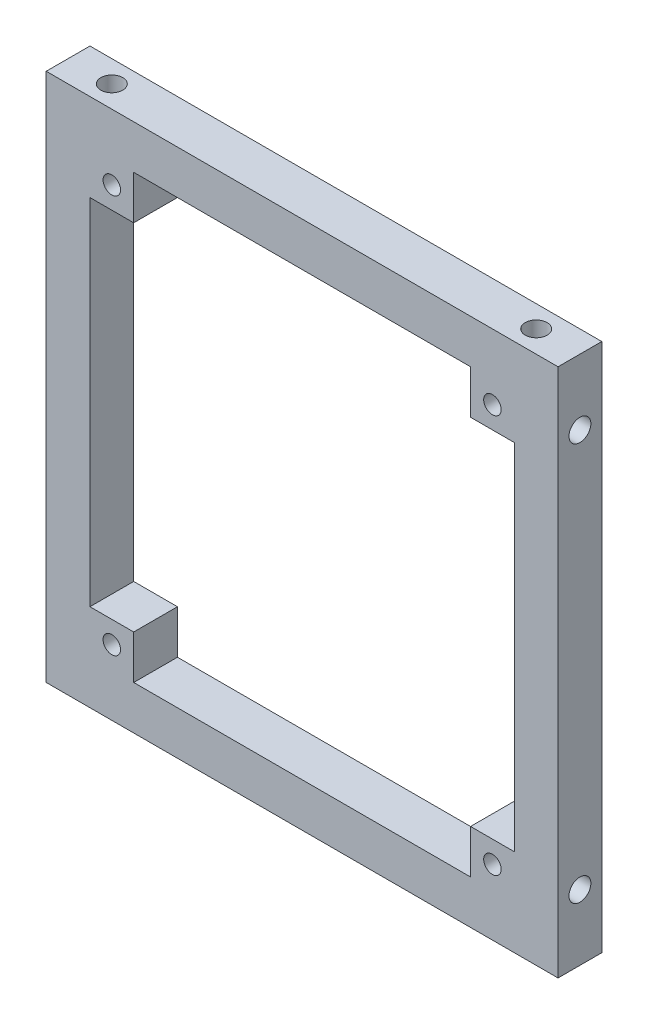
ISO-10303-21;
HEADER;
FILE_DESCRIPTION(('STEP AP214'),'2;1');
FILE_NAME('part.step','',(''),(''),'','','');
FILE_SCHEMA(('AUTOMOTIVE_DESIGN { 1 0 10303 214 1 1 1 1 }'));
ENDSEC;
DATA;
#1=APPLICATION_CONTEXT('core data for automotive mechanical design processes');
#2=APPLICATION_PROTOCOL_DEFINITION('international standard','automotive_design',2000,#1);
#3=PRODUCT_CONTEXT('',#1,'mechanical');
#4=PRODUCT('Part','Part','',(#3));
#5=PRODUCT_RELATED_PRODUCT_CATEGORY('part','',(#4));
#6=PRODUCT_DEFINITION_FORMATION('','',#4);
#7=PRODUCT_DEFINITION_CONTEXT('part definition',#1,'design');
#8=PRODUCT_DEFINITION('design','',#6,#7);
#9=PRODUCT_DEFINITION_SHAPE('','',#8);
#10=(LENGTH_UNIT() NAMED_UNIT(*) SI_UNIT(.MILLI.,.METRE.));
#11=(NAMED_UNIT(*) PLANE_ANGLE_UNIT() SI_UNIT($,.RADIAN.));
#12=(NAMED_UNIT(*) SI_UNIT($,.STERADIAN.) SOLID_ANGLE_UNIT());
#13=UNCERTAINTY_MEASURE_WITH_UNIT(LENGTH_MEASURE(1.E-05),#10,'distance_accuracy_value','');
#14=(GEOMETRIC_REPRESENTATION_CONTEXT(3) GLOBAL_UNCERTAINTY_ASSIGNED_CONTEXT((#13)) GLOBAL_UNIT_ASSIGNED_CONTEXT((#10,
#11,#12)) REPRESENTATION_CONTEXT('',''));
#15=CARTESIAN_POINT('',(0.,0.,0.));
#16=DIRECTION('',(0.,0.,1.));
#17=DIRECTION('',(1.,0.,0.));
#18=AXIS2_PLACEMENT_3D('',#15,#16,#17);
#19=CARTESIAN_POINT('',(0.,0.,4.));
#20=DIRECTION('',(0.,0.,1.));
#21=DIRECTION('',(1.,0.,0.));
#22=AXIS2_PLACEMENT_3D('',#19,#20,#21);
#23=PLANE('',#22);
#24=CARTESIAN_POINT('',(40.8000000000003,42.4,4.));
#25=DIRECTION('',(0.,0.,1.));
#26=DIRECTION('',(1.,0.,0.));
#27=AXIS2_PLACEMENT_3D('',#24,#25,#26);
#28=CIRCLE('',#27,0.799999999999996);
#29=CARTESIAN_POINT('',(41.6000000000003,42.4,4.));
#30=VERTEX_POINT('',#29);
#31=EDGE_CURVE('E367',#30,#30,#28,.T.);
#32=ORIENTED_EDGE('',*,*,#31,.F.);
#33=EDGE_LOOP('',(#32));
#34=FACE_BOUND('',#33,.T.);
#35=CARTESIAN_POINT('',(6.00000000000038,5.99999999999999,4.));
#36=DIRECTION('',(0.,0.,1.));
#37=DIRECTION('',(1.,0.,0.));
#38=AXIS2_PLACEMENT_3D('',#35,#36,#37);
#39=CIRCLE('',#38,0.8);
#40=CARTESIAN_POINT('',(6.80000000000038,5.99999999999999,4.));
#41=VERTEX_POINT('',#40);
#42=EDGE_CURVE('E195',#41,#41,#39,.T.);
#43=ORIENTED_EDGE('',*,*,#42,.F.);
#44=EDGE_LOOP('',(#43));
#45=FACE_BOUND('',#44,.T.);
#46=DIRECTION('',(0.,-1.,0.));
#47=VECTOR('',#46,1.);
#48=CARTESIAN_POINT('',(0.,48.4,4.));
#49=LINE('',#48,#47);
#50=CARTESIAN_POINT('',(0.,48.4,4.));
#51=VERTEX_POINT('',#50);
#52=CARTESIAN_POINT('',(0.,0.,4.));
#53=VERTEX_POINT('',#52);
#54=EDGE_CURVE('E245',#51,#53,#49,.T.);
#55=ORIENTED_EDGE('',*,*,#54,.T.);
#56=DIRECTION('',(1.,0.,0.));
#57=VECTOR('',#56,1.);
#58=CARTESIAN_POINT('',(0.,0.,4.));
#59=LINE('',#58,#57);
#60=CARTESIAN_POINT('',(46.8,0.,4.));
#61=VERTEX_POINT('',#60);
#62=EDGE_CURVE('E248',#53,#61,#59,.T.);
#63=ORIENTED_EDGE('',*,*,#62,.T.);
#64=DIRECTION('',(0.,1.,0.));
#65=VECTOR('',#64,1.);
#66=CARTESIAN_POINT('',(46.8,48.4,4.));
#67=LINE('',#66,#65);
#68=CARTESIAN_POINT('',(46.8,48.4,4.));
#69=VERTEX_POINT('',#68);
#70=EDGE_CURVE('E251',#61,#69,#67,.T.);
#71=ORIENTED_EDGE('',*,*,#70,.T.);
#72=DIRECTION('',(-1.,0.,0.));
#73=VECTOR('',#72,1.);
#74=CARTESIAN_POINT('',(0.,48.4,4.));
#75=LINE('',#74,#73);
#76=EDGE_CURVE('E253',#69,#51,#75,.T.);
#77=ORIENTED_EDGE('',*,*,#76,.T.);
#78=EDGE_LOOP('',(#55,#63,#71,#77));
#79=FACE_BOUND('',#78,.T.);
#80=DIRECTION('',(-1.,0.,0.));
#81=VECTOR('',#80,1.);
#82=CARTESIAN_POINT('',(4.,40.4,4.));
#83=LINE('',#82,#81);
#84=CARTESIAN_POINT('',(8.,40.4,4.));
#85=VERTEX_POINT('',#84);
#86=CARTESIAN_POINT('',(4.,40.4,4.));
#87=VERTEX_POINT('',#86);
#88=EDGE_CURVE('E157',#85,#87,#83,.T.);
#89=ORIENTED_EDGE('',*,*,#88,.F.);
#90=DIRECTION('',(0.,-1.,0.));
#91=VECTOR('',#90,1.);
#92=CARTESIAN_POINT('',(8.,44.4,4.));
#93=LINE('',#92,#91);
#94=CARTESIAN_POINT('',(8.,44.4,4.));
#95=VERTEX_POINT('',#94);
#96=EDGE_CURVE('E149',#95,#85,#93,.T.);
#97=ORIENTED_EDGE('',*,*,#96,.F.);
#98=DIRECTION('',(-1.,0.,0.));
#99=VECTOR('',#98,1.);
#100=CARTESIAN_POINT('',(8.,44.4,4.));
#101=LINE('',#100,#99);
#102=CARTESIAN_POINT('',(38.8,44.4,4.));
#103=VERTEX_POINT('',#102);
#104=EDGE_CURVE('E192',#103,#95,#101,.T.);
#105=ORIENTED_EDGE('',*,*,#104,.F.);
#106=DIRECTION('',(0.,1.,0.));
#107=VECTOR('',#106,1.);
#108=CARTESIAN_POINT('',(38.8,44.4,4.));
#109=LINE('',#108,#107);
#110=CARTESIAN_POINT('',(38.8,40.4,4.));
#111=VERTEX_POINT('',#110);
#112=EDGE_CURVE('E190',#111,#103,#109,.T.);
#113=ORIENTED_EDGE('',*,*,#112,.F.);
#114=DIRECTION('',(-1.,0.,0.));
#115=VECTOR('',#114,1.);
#116=CARTESIAN_POINT('',(38.8,40.4,4.));
#117=LINE('',#116,#115);
#118=CARTESIAN_POINT('',(42.8,40.4,4.));
#119=VERTEX_POINT('',#118);
#120=EDGE_CURVE('E188',#119,#111,#117,.T.);
#121=ORIENTED_EDGE('',*,*,#120,.F.);
#122=DIRECTION('',(0.,1.,0.));
#123=VECTOR('',#122,1.);
#124=CARTESIAN_POINT('',(42.8,40.4,4.));
#125=LINE('',#124,#123);
#126=CARTESIAN_POINT('',(42.8000000000004,7.99999999999999,4.));
#127=VERTEX_POINT('',#126);
#128=EDGE_CURVE('E186',#127,#119,#125,.T.);
#129=ORIENTED_EDGE('',*,*,#128,.F.);
#130=DIRECTION('',(1.,0.,0.));
#131=VECTOR('',#130,1.);
#132=CARTESIAN_POINT('',(38.8000000000004,7.99999999999999,4.));
#133=LINE('',#132,#131);
#134=CARTESIAN_POINT('',(38.8000000000004,7.99999999999999,4.));
#135=VERTEX_POINT('',#134);
#136=EDGE_CURVE('E184',#135,#127,#133,.T.);
#137=ORIENTED_EDGE('',*,*,#136,.F.);
#138=DIRECTION('',(0.,1.,0.));
#139=VECTOR('',#138,1.);
#140=CARTESIAN_POINT('',(38.8000000000004,7.99999999999999,4.));
#141=LINE('',#140,#139);
#142=CARTESIAN_POINT('',(38.8000000000004,3.99999999999999,4.));
#143=VERTEX_POINT('',#142);
#144=EDGE_CURVE('E182',#143,#135,#141,.T.);
#145=ORIENTED_EDGE('',*,*,#144,.F.);
#146=DIRECTION('',(1.,0.,0.));
#147=VECTOR('',#146,1.);
#148=CARTESIAN_POINT('',(8.00000000000038,3.99999999999999,4.));
#149=LINE('',#148,#147);
#150=CARTESIAN_POINT('',(8.00000000000038,3.99999999999999,4.));
#151=VERTEX_POINT('',#150);
#152=EDGE_CURVE('E180',#151,#143,#149,.T.);
#153=ORIENTED_EDGE('',*,*,#152,.F.);
#154=DIRECTION('',(0.,-1.,0.));
#155=VECTOR('',#154,1.);
#156=CARTESIAN_POINT('',(8.00000000000038,7.99999999999999,4.));
#157=LINE('',#156,#155);
#158=CARTESIAN_POINT('',(8.00000000000038,7.99999999999999,4.));
#159=VERTEX_POINT('',#158);
#160=EDGE_CURVE('E178',#159,#151,#157,.T.);
#161=ORIENTED_EDGE('',*,*,#160,.F.);
#162=DIRECTION('',(1.,0.,0.));
#163=VECTOR('',#162,1.);
#164=CARTESIAN_POINT('',(4.00000000000038,7.99999999999999,4.));
#165=LINE('',#164,#163);
#166=CARTESIAN_POINT('',(4.00000000000038,7.99999999999999,4.));
#167=VERTEX_POINT('',#166);
#168=EDGE_CURVE('E173',#167,#159,#165,.T.);
#169=ORIENTED_EDGE('',*,*,#168,.F.);
#170=DIRECTION('',(0.,-1.,0.));
#171=VECTOR('',#170,1.);
#172=CARTESIAN_POINT('',(4.,40.4,4.));
#173=LINE('',#172,#171);
#174=EDGE_CURVE('E171',#87,#167,#173,.T.);
#175=ORIENTED_EDGE('',*,*,#174,.F.);
#176=EDGE_LOOP('',(#89,#97,#105,#113,#121,#129,#137,#145,#153,#161,#169,#175));
#177=FACE_BOUND('',#176,.T.);
#178=CARTESIAN_POINT('',(40.8000000000004,5.99999999999999,4.));
#179=DIRECTION('',(0.,0.,1.));
#180=DIRECTION('',(1.,0.,0.));
#181=AXIS2_PLACEMENT_3D('',#178,#179,#180);
#182=CIRCLE('',#181,0.799999999999996);
#183=CARTESIAN_POINT('',(41.6000000000004,5.99999999999999,4.));
#184=VERTEX_POINT('',#183);
#185=EDGE_CURVE('E373',#184,#184,#182,.T.);
#186=ORIENTED_EDGE('',*,*,#185,.F.);
#187=EDGE_LOOP('',(#186));
#188=FACE_BOUND('',#187,.T.);
#189=CARTESIAN_POINT('',(6.00000000000025,42.4,4.));
#190=DIRECTION('',(0.,0.,1.));
#191=DIRECTION('',(1.,0.,0.));
#192=AXIS2_PLACEMENT_3D('',#189,#190,#191);
#193=CIRCLE('',#192,0.800000000000001);
#194=CARTESIAN_POINT('',(6.80000000000025,42.4,4.));
#195=VERTEX_POINT('',#194);
#196=EDGE_CURVE('E361',#195,#195,#193,.T.);
#197=ORIENTED_EDGE('',*,*,#196,.F.);
#198=EDGE_LOOP('',(#197));
#199=FACE_BOUND('',#198,.T.);
#200=ADVANCED_FACE('F36',(#34,#45,#79,#177,#188,#199),#23,.T.);
#201=CARTESIAN_POINT('',(0.,0.,0.));
#202=DIRECTION('',(0.,0.,1.));
#203=DIRECTION('',(1.,0.,0.));
#204=AXIS2_PLACEMENT_3D('',#201,#202,#203);
#205=PLANE('',#204);
#206=DIRECTION('',(0.,-1.,0.));
#207=VECTOR('',#206,1.);
#208=CARTESIAN_POINT('',(0.,48.4,0.));
#209=LINE('',#208,#207);
#210=CARTESIAN_POINT('',(0.,48.4,0.));
#211=VERTEX_POINT('',#210);
#212=CARTESIAN_POINT('',(0.,0.,0.));
#213=VERTEX_POINT('',#212);
#214=EDGE_CURVE('E165',#211,#213,#209,.T.);
#215=ORIENTED_EDGE('',*,*,#214,.F.);
#216=DIRECTION('',(-1.,0.,0.));
#217=VECTOR('',#216,1.);
#218=CARTESIAN_POINT('',(0.,48.4,0.));
#219=LINE('',#218,#217);
#220=CARTESIAN_POINT('',(46.8,48.4,0.));
#221=VERTEX_POINT('',#220);
#222=EDGE_CURVE('E249',#221,#211,#219,.T.);
#223=ORIENTED_EDGE('',*,*,#222,.F.);
#224=DIRECTION('',(0.,1.,0.));
#225=VECTOR('',#224,1.);
#226=CARTESIAN_POINT('',(46.8,48.4,0.));
#227=LINE('',#226,#225);
#228=CARTESIAN_POINT('',(46.8,0.,0.));
#229=VERTEX_POINT('',#228);
#230=EDGE_CURVE('E260',#229,#221,#227,.T.);
#231=ORIENTED_EDGE('',*,*,#230,.F.);
#232=DIRECTION('',(1.,0.,0.));
#233=VECTOR('',#232,1.);
#234=CARTESIAN_POINT('',(0.,0.,0.));
#235=LINE('',#234,#233);
#236=EDGE_CURVE('E258',#213,#229,#235,.T.);
#237=ORIENTED_EDGE('',*,*,#236,.F.);
#238=EDGE_LOOP('',(#215,#223,#231,#237));
#239=FACE_BOUND('',#238,.T.);
#240=DIRECTION('',(0.,-1.,0.));
#241=VECTOR('',#240,1.);
#242=CARTESIAN_POINT('',(8.,44.4,0.));
#243=LINE('',#242,#241);
#244=CARTESIAN_POINT('',(8.,44.4,0.));
#245=VERTEX_POINT('',#244);
#246=CARTESIAN_POINT('',(8.,40.4,0.));
#247=VERTEX_POINT('',#246);
#248=EDGE_CURVE('E59',#245,#247,#243,.T.);
#249=ORIENTED_EDGE('',*,*,#248,.T.);
#250=DIRECTION('',(-1.,0.,0.));
#251=VECTOR('',#250,1.);
#252=CARTESIAN_POINT('',(4.,40.4,0.));
#253=LINE('',#252,#251);
#254=CARTESIAN_POINT('',(4.,40.4,0.));
#255=VERTEX_POINT('',#254);
#256=EDGE_CURVE('E164',#247,#255,#253,.T.);
#257=ORIENTED_EDGE('',*,*,#256,.T.);
#258=DIRECTION('',(0.,-1.,0.));
#259=VECTOR('',#258,1.);
#260=CARTESIAN_POINT('',(4.,40.4,0.));
#261=LINE('',#260,#259);
#262=CARTESIAN_POINT('',(4.00000000000038,7.99999999999999,0.));
#263=VERTEX_POINT('',#262);
#264=EDGE_CURVE('E197',#255,#263,#261,.T.);
#265=ORIENTED_EDGE('',*,*,#264,.T.);
#266=DIRECTION('',(1.,0.,0.));
#267=VECTOR('',#266,1.);
#268=CARTESIAN_POINT('',(4.00000000000038,7.99999999999999,0.));
#269=LINE('',#268,#267);
#270=CARTESIAN_POINT('',(8.00000000000038,7.99999999999999,0.));
#271=VERTEX_POINT('',#270);
#272=EDGE_CURVE('E200',#263,#271,#269,.T.);
#273=ORIENTED_EDGE('',*,*,#272,.T.);
#274=DIRECTION('',(0.,-1.,0.));
#275=VECTOR('',#274,1.);
#276=CARTESIAN_POINT('',(8.00000000000038,7.99999999999999,0.));
#277=LINE('',#276,#275);
#278=CARTESIAN_POINT('',(8.00000000000038,3.99999999999999,0.));
#279=VERTEX_POINT('',#278);
#280=EDGE_CURVE('E203',#271,#279,#277,.T.);
#281=ORIENTED_EDGE('',*,*,#280,.T.);
#282=DIRECTION('',(1.,0.,0.));
#283=VECTOR('',#282,1.);
#284=CARTESIAN_POINT('',(8.00000000000038,3.99999999999999,0.));
#285=LINE('',#284,#283);
#286=CARTESIAN_POINT('',(38.8000000000004,3.99999999999999,0.));
#287=VERTEX_POINT('',#286);
#288=EDGE_CURVE('E206',#279,#287,#285,.T.);
#289=ORIENTED_EDGE('',*,*,#288,.T.);
#290=DIRECTION('',(0.,1.,0.));
#291=VECTOR('',#290,1.);
#292=CARTESIAN_POINT('',(38.8000000000004,7.99999999999999,0.));
#293=LINE('',#292,#291);
#294=CARTESIAN_POINT('',(38.8000000000004,7.99999999999999,0.));
#295=VERTEX_POINT('',#294);
#296=EDGE_CURVE('E209',#287,#295,#293,.T.);
#297=ORIENTED_EDGE('',*,*,#296,.T.);
#298=DIRECTION('',(1.,0.,0.));
#299=VECTOR('',#298,1.);
#300=CARTESIAN_POINT('',(38.8000000000004,7.99999999999999,0.));
#301=LINE('',#300,#299);
#302=CARTESIAN_POINT('',(42.8000000000004,7.99999999999999,0.));
#303=VERTEX_POINT('',#302);
#304=EDGE_CURVE('E212',#295,#303,#301,.T.);
#305=ORIENTED_EDGE('',*,*,#304,.T.);
#306=DIRECTION('',(0.,1.,0.));
#307=VECTOR('',#306,1.);
#308=CARTESIAN_POINT('',(42.8,40.4,0.));
#309=LINE('',#308,#307);
#310=CARTESIAN_POINT('',(42.8,40.4,0.));
#311=VERTEX_POINT('',#310);
#312=EDGE_CURVE('E215',#303,#311,#309,.T.);
#313=ORIENTED_EDGE('',*,*,#312,.T.);
#314=DIRECTION('',(-1.,0.,0.));
#315=VECTOR('',#314,1.);
#316=CARTESIAN_POINT('',(38.8,40.4,0.));
#317=LINE('',#316,#315);
#318=CARTESIAN_POINT('',(38.8,40.4,0.));
#319=VERTEX_POINT('',#318);
#320=EDGE_CURVE('E218',#311,#319,#317,.T.);
#321=ORIENTED_EDGE('',*,*,#320,.T.);
#322=DIRECTION('',(0.,1.,0.));
#323=VECTOR('',#322,1.);
#324=CARTESIAN_POINT('',(38.8,44.4,0.));
#325=LINE('',#324,#323);
#326=CARTESIAN_POINT('',(38.8,44.4,0.));
#327=VERTEX_POINT('',#326);
#328=EDGE_CURVE('E221',#319,#327,#325,.T.);
#329=ORIENTED_EDGE('',*,*,#328,.T.);
#330=DIRECTION('',(-1.,0.,0.));
#331=VECTOR('',#330,1.);
#332=CARTESIAN_POINT('',(8.,44.4,0.));
#333=LINE('',#332,#331);
#334=EDGE_CURVE('E158',#327,#245,#333,.T.);
#335=ORIENTED_EDGE('',*,*,#334,.T.);
#336=EDGE_LOOP('',(#249,#257,#265,#273,#281,#289,#297,#305,#313,#321,#329,#335));
#337=FACE_BOUND('',#336,.T.);
#338=CARTESIAN_POINT('',(6.00000000000038,5.99999999999999,0.));
#339=DIRECTION('',(0.,0.,1.));
#340=DIRECTION('',(1.,0.,0.));
#341=AXIS2_PLACEMENT_3D('',#338,#339,#340);
#342=CIRCLE('',#341,0.8);
#343=CARTESIAN_POINT('',(6.80000000000038,5.99999999999999,0.));
#344=VERTEX_POINT('',#343);
#345=EDGE_CURVE('E376',#344,#344,#342,.T.);
#346=ORIENTED_EDGE('',*,*,#345,.T.);
#347=EDGE_LOOP('',(#346));
#348=FACE_BOUND('',#347,.T.);
#349=CARTESIAN_POINT('',(40.8000000000004,5.99999999999999,0.));
#350=DIRECTION('',(0.,0.,1.));
#351=DIRECTION('',(1.,0.,0.));
#352=AXIS2_PLACEMENT_3D('',#349,#350,#351);
#353=CIRCLE('',#352,0.799999999999996);
#354=CARTESIAN_POINT('',(41.6000000000004,5.99999999999999,0.));
#355=VERTEX_POINT('',#354);
#356=EDGE_CURVE('E370',#355,#355,#353,.T.);
#357=ORIENTED_EDGE('',*,*,#356,.T.);
#358=EDGE_LOOP('',(#357));
#359=FACE_BOUND('',#358,.T.);
#360=CARTESIAN_POINT('',(40.8000000000003,42.4,0.));
#361=DIRECTION('',(0.,0.,1.));
#362=DIRECTION('',(1.,0.,0.));
#363=AXIS2_PLACEMENT_3D('',#360,#361,#362);
#364=CIRCLE('',#363,0.799999999999996);
#365=CARTESIAN_POINT('',(41.6000000000003,42.4,0.));
#366=VERTEX_POINT('',#365);
#367=EDGE_CURVE('E364',#366,#366,#364,.T.);
#368=ORIENTED_EDGE('',*,*,#367,.T.);
#369=EDGE_LOOP('',(#368));
#370=FACE_BOUND('',#369,.T.);
#371=CARTESIAN_POINT('',(6.00000000000025,42.4,0.));
#372=DIRECTION('',(0.,0.,1.));
#373=DIRECTION('',(1.,0.,0.));
#374=AXIS2_PLACEMENT_3D('',#371,#372,#373);
#375=CIRCLE('',#374,0.800000000000001);
#376=CARTESIAN_POINT('',(6.80000000000025,42.4,0.));
#377=VERTEX_POINT('',#376);
#378=EDGE_CURVE('E352',#377,#377,#375,.T.);
#379=ORIENTED_EDGE('',*,*,#378,.T.);
#380=EDGE_LOOP('',(#379));
#381=FACE_BOUND('',#380,.T.);
#382=ADVANCED_FACE('F278',(#239,#337,#348,#359,#370,#381),#205,.F.);
#383=CARTESIAN_POINT('',(0.,48.4,4.));
#384=DIRECTION('',(1.,0.,0.));
#385=DIRECTION('',(0.,1.,0.));
#386=AXIS2_PLACEMENT_3D('',#383,#384,#385);
#387=PLANE('',#386);
#388=CARTESIAN_POINT('',(0.,6.,2.));
#389=DIRECTION('',(-1.,0.,0.));
#390=DIRECTION('',(0.,-1.,0.));
#391=AXIS2_PLACEMENT_3D('',#388,#389,#390);
#392=CIRCLE('',#391,1.);
#393=CARTESIAN_POINT('',(0.,5.,2.));
#394=VERTEX_POINT('',#393);
#395=EDGE_CURVE('E339',#394,#394,#392,.T.);
#396=ORIENTED_EDGE('',*,*,#395,.F.);
#397=EDGE_LOOP('',(#396));
#398=FACE_BOUND('',#397,.T.);
#399=CARTESIAN_POINT('',(0.,42.4,1.99999999999988));
#400=DIRECTION('',(-1.,0.,0.));
#401=DIRECTION('',(0.,-1.,0.));
#402=AXIS2_PLACEMENT_3D('',#399,#400,#401);
#403=CIRCLE('',#402,1.);
#404=CARTESIAN_POINT('',(0.,41.4,1.99999999999988));
#405=VERTEX_POINT('',#404);
#406=EDGE_CURVE('E345',#405,#405,#403,.T.);
#407=ORIENTED_EDGE('',*,*,#406,.F.);
#408=EDGE_LOOP('',(#407));
#409=FACE_BOUND('',#408,.T.);
#410=ORIENTED_EDGE('',*,*,#214,.T.);
#411=DIRECTION('',(0.,0.,-1.));
#412=VECTOR('',#411,1.);
#413=CARTESIAN_POINT('',(0.,0.,4.));
#414=LINE('',#413,#412);
#415=EDGE_CURVE('E11',#53,#213,#414,.T.);
#416=ORIENTED_EDGE('',*,*,#415,.F.);
#417=ORIENTED_EDGE('',*,*,#54,.F.);
#418=DIRECTION('',(0.,0.,-1.));
#419=VECTOR('',#418,1.);
#420=CARTESIAN_POINT('',(0.,48.4,4.));
#421=LINE('',#420,#419);
#422=EDGE_CURVE('E255',#51,#211,#421,.T.);
#423=ORIENTED_EDGE('',*,*,#422,.T.);
#424=EDGE_LOOP('',(#410,#416,#417,#423));
#425=FACE_BOUND('',#424,.T.);
#426=ADVANCED_FACE('F38',(#398,#409,#425),#387,.F.);
#427=CARTESIAN_POINT('',(0.,0.,4.));
#428=DIRECTION('',(0.,1.,0.));
#429=DIRECTION('',(0.,0.,1.));
#430=AXIS2_PLACEMENT_3D('',#427,#428,#429);
#431=PLANE('',#430);
#432=CARTESIAN_POINT('',(4.,0.,2.));
#433=DIRECTION('',(0.,-1.,0.));
#434=DIRECTION('',(0.,0.,-1.));
#435=AXIS2_PLACEMENT_3D('',#432,#433,#434);
#436=CIRCLE('',#435,1.);
#437=CARTESIAN_POINT('',(4.,0.,1.));
#438=VERTEX_POINT('',#437);
#439=EDGE_CURVE('E331',#438,#438,#436,.T.);
#440=ORIENTED_EDGE('',*,*,#439,.F.);
#441=EDGE_LOOP('',(#440));
#442=FACE_BOUND('',#441,.T.);
#443=CARTESIAN_POINT('',(42.8,0.,2.));
#444=DIRECTION('',(0.,-1.,0.));
#445=DIRECTION('',(0.,0.,-1.));
#446=AXIS2_PLACEMENT_3D('',#443,#444,#445);
#447=CIRCLE('',#446,1.);
#448=CARTESIAN_POINT('',(42.8,0.,0.999999999999995));
#449=VERTEX_POINT('',#448);
#450=EDGE_CURVE('E701',#449,#449,#447,.T.);
#451=ORIENTED_EDGE('',*,*,#450,.F.);
#452=EDGE_LOOP('',(#451));
#453=FACE_BOUND('',#452,.T.);
#454=ORIENTED_EDGE('',*,*,#236,.T.);
#455=DIRECTION('',(0.,0.,-1.));
#456=VECTOR('',#455,1.);
#457=CARTESIAN_POINT('',(46.8,0.,4.));
#458=LINE('',#457,#456);
#459=EDGE_CURVE('E44',#61,#229,#458,.T.);
#460=ORIENTED_EDGE('',*,*,#459,.F.);
#461=ORIENTED_EDGE('',*,*,#62,.F.);
#462=ORIENTED_EDGE('',*,*,#415,.T.);
#463=EDGE_LOOP('',(#454,#460,#461,#462));
#464=FACE_BOUND('',#463,.T.);
#465=ADVANCED_FACE('F288',(#442,#453,#464),#431,.F.);
#466=CARTESIAN_POINT('',(46.8,48.4,4.));
#467=DIRECTION('',(-1.,0.,0.));
#468=DIRECTION('',(0.,-1.,0.));
#469=AXIS2_PLACEMENT_3D('',#466,#467,#468);
#470=PLANE('',#469);
#471=CARTESIAN_POINT('',(46.8,6.00000000000001,2.));
#472=DIRECTION('',(1.,0.,0.));
#473=DIRECTION('',(0.,1.,0.));
#474=AXIS2_PLACEMENT_3D('',#471,#472,#473);
#475=CIRCLE('',#474,1.);
#476=CARTESIAN_POINT('',(46.8,7.00000000000001,2.));
#477=VERTEX_POINT('',#476);
#478=EDGE_CURVE('E353',#477,#477,#475,.T.);
#479=ORIENTED_EDGE('',*,*,#478,.F.);
#480=EDGE_LOOP('',(#479));
#481=FACE_BOUND('',#480,.T.);
#482=CARTESIAN_POINT('',(46.8,42.4,2.00000000000012));
#483=DIRECTION('',(1.,0.,0.));
#484=DIRECTION('',(0.,1.,0.));
#485=AXIS2_PLACEMENT_3D('',#482,#483,#484);
#486=CIRCLE('',#485,1.);
#487=CARTESIAN_POINT('',(46.8,43.4,2.00000000000012));
#488=VERTEX_POINT('',#487);
#489=EDGE_CURVE('E338',#488,#488,#486,.T.);
#490=ORIENTED_EDGE('',*,*,#489,.F.);
#491=EDGE_LOOP('',(#490));
#492=FACE_BOUND('',#491,.T.);
#493=ORIENTED_EDGE('',*,*,#230,.T.);
#494=DIRECTION('',(0.,0.,-1.));
#495=VECTOR('',#494,1.);
#496=CARTESIAN_POINT('',(46.8,48.4,4.));
#497=LINE('',#496,#495);
#498=EDGE_CURVE('E265',#69,#221,#497,.T.);
#499=ORIENTED_EDGE('',*,*,#498,.F.);
#500=ORIENTED_EDGE('',*,*,#70,.F.);
#501=ORIENTED_EDGE('',*,*,#459,.T.);
#502=EDGE_LOOP('',(#493,#499,#500,#501));
#503=FACE_BOUND('',#502,.T.);
#504=ADVANCED_FACE('F272',(#481,#492,#503),#470,.F.);
#505=CARTESIAN_POINT('',(0.,48.4,4.));
#506=DIRECTION('',(0.,-1.,0.));
#507=DIRECTION('',(0.,0.,-1.));
#508=AXIS2_PLACEMENT_3D('',#505,#506,#507);
#509=PLANE('',#508);
#510=CARTESIAN_POINT('',(4.,48.4,2.));
#511=DIRECTION('',(0.,1.,0.));
#512=DIRECTION('',(0.,0.,1.));
#513=AXIS2_PLACEMENT_3D('',#510,#511,#512);
#514=CIRCLE('',#513,1.);
#515=CARTESIAN_POINT('',(4.,48.4,3.));
#516=VERTEX_POINT('',#515);
#517=EDGE_CURVE('E320',#516,#516,#514,.T.);
#518=ORIENTED_EDGE('',*,*,#517,.F.);
#519=EDGE_LOOP('',(#518));
#520=FACE_BOUND('',#519,.T.);
#521=CARTESIAN_POINT('',(42.8,48.4,2.));
#522=DIRECTION('',(0.,1.,0.));
#523=DIRECTION('',(0.,0.,1.));
#524=AXIS2_PLACEMENT_3D('',#521,#522,#523);
#525=CIRCLE('',#524,1.);
#526=CARTESIAN_POINT('',(42.8,48.4,3.));
#527=VERTEX_POINT('',#526);
#528=EDGE_CURVE('E323',#527,#527,#525,.T.);
#529=ORIENTED_EDGE('',*,*,#528,.F.);
#530=EDGE_LOOP('',(#529));
#531=FACE_BOUND('',#530,.T.);
#532=ORIENTED_EDGE('',*,*,#222,.T.);
#533=ORIENTED_EDGE('',*,*,#422,.F.);
#534=ORIENTED_EDGE('',*,*,#76,.F.);
#535=ORIENTED_EDGE('',*,*,#498,.T.);
#536=EDGE_LOOP('',(#532,#533,#534,#535));
#537=FACE_BOUND('',#536,.T.);
#538=ADVANCED_FACE('F282',(#520,#531,#537),#509,.F.);
#539=CARTESIAN_POINT('',(8.,44.4,4.));
#540=DIRECTION('',(1.,0.,0.));
#541=DIRECTION('',(0.,0.,-1.));
#542=AXIS2_PLACEMENT_3D('',#539,#540,#541);
#543=PLANE('',#542);
#544=ORIENTED_EDGE('',*,*,#248,.F.);
#545=DIRECTION('',(0.,0.,-1.));
#546=VECTOR('',#545,1.);
#547=CARTESIAN_POINT('',(8.,44.4,4.));
#548=LINE('',#547,#546);
#549=EDGE_CURVE('E153',#95,#245,#548,.T.);
#550=ORIENTED_EDGE('',*,*,#549,.F.);
#551=ORIENTED_EDGE('',*,*,#96,.T.);
#552=DIRECTION('',(0.,0.,-1.));
#553=VECTOR('',#552,1.);
#554=CARTESIAN_POINT('',(8.,40.4,4.));
#555=LINE('',#554,#553);
#556=EDGE_CURVE('E152',#85,#247,#555,.T.);
#557=ORIENTED_EDGE('',*,*,#556,.T.);
#558=EDGE_LOOP('',(#544,#550,#551,#557));
#559=FACE_BOUND('',#558,.T.);
#560=ADVANCED_FACE('F151',(#559),#543,.T.);
#561=CARTESIAN_POINT('',(4.,40.4,4.));
#562=DIRECTION('',(0.,-1.,0.));
#563=DIRECTION('',(0.,0.,-1.));
#564=AXIS2_PLACEMENT_3D('',#561,#562,#563);
#565=PLANE('',#564);
#566=ORIENTED_EDGE('',*,*,#256,.F.);
#567=ORIENTED_EDGE('',*,*,#556,.F.);
#568=ORIENTED_EDGE('',*,*,#88,.T.);
#569=DIRECTION('',(0.,0.,-1.));
#570=VECTOR('',#569,1.);
#571=CARTESIAN_POINT('',(4.,40.4,4.));
#572=LINE('',#571,#570);
#573=EDGE_CURVE('E166',#87,#255,#572,.T.);
#574=ORIENTED_EDGE('',*,*,#573,.T.);
#575=EDGE_LOOP('',(#566,#567,#568,#574));
#576=FACE_BOUND('',#575,.T.);
#577=ADVANCED_FACE('F161',(#576),#565,.T.);
#578=CARTESIAN_POINT('',(4.,40.4,4.));
#579=DIRECTION('',(1.,0.,0.));
#580=DIRECTION('',(0.,1.,0.));
#581=AXIS2_PLACEMENT_3D('',#578,#579,#580);
#582=PLANE('',#581);
#583=ORIENTED_EDGE('',*,*,#264,.F.);
#584=ORIENTED_EDGE('',*,*,#573,.F.);
#585=ORIENTED_EDGE('',*,*,#174,.T.);
#586=DIRECTION('',(0.,0.,-1.));
#587=VECTOR('',#586,1.);
#588=CARTESIAN_POINT('',(4.00000000000038,7.99999999999999,4.));
#589=LINE('',#588,#587);
#590=EDGE_CURVE('E242',#167,#263,#589,.T.);
#591=ORIENTED_EDGE('',*,*,#590,.T.);
#592=EDGE_LOOP('',(#583,#584,#585,#591));
#593=FACE_BOUND('',#592,.T.);
#594=ADVANCED_FACE('F432',(#593),#582,.T.);
#595=CARTESIAN_POINT('',(4.00000000000038,7.99999999999999,4.));
#596=DIRECTION('',(0.,1.,0.));
#597=DIRECTION('',(0.,0.,1.));
#598=AXIS2_PLACEMENT_3D('',#595,#596,#597);
#599=PLANE('',#598);
#600=ORIENTED_EDGE('',*,*,#272,.F.);
#601=ORIENTED_EDGE('',*,*,#590,.F.);
#602=ORIENTED_EDGE('',*,*,#168,.T.);
#603=DIRECTION('',(0.,0.,-1.));
#604=VECTOR('',#603,1.);
#605=CARTESIAN_POINT('',(8.00000000000038,7.99999999999999,4.));
#606=LINE('',#605,#604);
#607=EDGE_CURVE('E240',#159,#271,#606,.T.);
#608=ORIENTED_EDGE('',*,*,#607,.T.);
#609=EDGE_LOOP('',(#600,#601,#602,#608));
#610=FACE_BOUND('',#609,.T.);
#611=ADVANCED_FACE('F428',(#610),#599,.T.);
#612=CARTESIAN_POINT('',(8.00000000000038,7.99999999999999,4.));
#613=DIRECTION('',(1.,0.,0.));
#614=DIRECTION('',(0.,0.,-1.));
#615=AXIS2_PLACEMENT_3D('',#612,#613,#614);
#616=PLANE('',#615);
#617=ORIENTED_EDGE('',*,*,#280,.F.);
#618=ORIENTED_EDGE('',*,*,#607,.F.);
#619=ORIENTED_EDGE('',*,*,#160,.T.);
#620=DIRECTION('',(0.,0.,-1.));
#621=VECTOR('',#620,1.);
#622=CARTESIAN_POINT('',(8.00000000000038,3.99999999999999,4.));
#623=LINE('',#622,#621);
#624=EDGE_CURVE('E238',#151,#279,#623,.T.);
#625=ORIENTED_EDGE('',*,*,#624,.T.);
#626=EDGE_LOOP('',(#617,#618,#619,#625));
#627=FACE_BOUND('',#626,.T.);
#628=ADVANCED_FACE('F424',(#627),#616,.T.);
#629=CARTESIAN_POINT('',(8.00000000000038,3.99999999999999,4.));
#630=DIRECTION('',(0.,1.,0.));
#631=DIRECTION('',(0.,0.,1.));
#632=AXIS2_PLACEMENT_3D('',#629,#630,#631);
#633=PLANE('',#632);
#634=ORIENTED_EDGE('',*,*,#288,.F.);
#635=ORIENTED_EDGE('',*,*,#624,.F.);
#636=ORIENTED_EDGE('',*,*,#152,.T.);
#637=DIRECTION('',(0.,0.,-1.));
#638=VECTOR('',#637,1.);
#639=CARTESIAN_POINT('',(38.8000000000004,3.99999999999999,4.));
#640=LINE('',#639,#638);
#641=EDGE_CURVE('E236',#143,#287,#640,.T.);
#642=ORIENTED_EDGE('',*,*,#641,.T.);
#643=EDGE_LOOP('',(#634,#635,#636,#642));
#644=FACE_BOUND('',#643,.T.);
#645=ADVANCED_FACE('F420',(#644),#633,.T.);
#646=CARTESIAN_POINT('',(38.8000000000004,7.99999999999999,4.));
#647=DIRECTION('',(-1.,0.,0.));
#648=DIRECTION('',(0.,0.,1.));
#649=AXIS2_PLACEMENT_3D('',#646,#647,#648);
#650=PLANE('',#649);
#651=ORIENTED_EDGE('',*,*,#296,.F.);
#652=ORIENTED_EDGE('',*,*,#641,.F.);
#653=ORIENTED_EDGE('',*,*,#144,.T.);
#654=DIRECTION('',(0.,0.,-1.));
#655=VECTOR('',#654,1.);
#656=CARTESIAN_POINT('',(38.8000000000004,7.99999999999999,4.));
#657=LINE('',#656,#655);
#658=EDGE_CURVE('E234',#135,#295,#657,.T.);
#659=ORIENTED_EDGE('',*,*,#658,.T.);
#660=EDGE_LOOP('',(#651,#652,#653,#659));
#661=FACE_BOUND('',#660,.T.);
#662=ADVANCED_FACE('F416',(#661),#650,.T.);
#663=CARTESIAN_POINT('',(38.8000000000004,7.99999999999999,4.));
#664=DIRECTION('',(0.,1.,0.));
#665=DIRECTION('',(0.,0.,1.));
#666=AXIS2_PLACEMENT_3D('',#663,#664,#665);
#667=PLANE('',#666);
#668=ORIENTED_EDGE('',*,*,#304,.F.);
#669=ORIENTED_EDGE('',*,*,#658,.F.);
#670=ORIENTED_EDGE('',*,*,#136,.T.);
#671=DIRECTION('',(0.,0.,-1.));
#672=VECTOR('',#671,1.);
#673=CARTESIAN_POINT('',(42.8000000000004,7.99999999999999,4.));
#674=LINE('',#673,#672);
#675=EDGE_CURVE('E232',#127,#303,#674,.T.);
#676=ORIENTED_EDGE('',*,*,#675,.T.);
#677=EDGE_LOOP('',(#668,#669,#670,#676));
#678=FACE_BOUND('',#677,.T.);
#679=ADVANCED_FACE('F412',(#678),#667,.T.);
#680=CARTESIAN_POINT('',(42.8,40.4,4.));
#681=DIRECTION('',(-1.,0.,0.));
#682=DIRECTION('',(0.,-1.,0.));
#683=AXIS2_PLACEMENT_3D('',#680,#681,#682);
#684=PLANE('',#683);
#685=ORIENTED_EDGE('',*,*,#312,.F.);
#686=ORIENTED_EDGE('',*,*,#675,.F.);
#687=ORIENTED_EDGE('',*,*,#128,.T.);
#688=DIRECTION('',(0.,0.,-1.));
#689=VECTOR('',#688,1.);
#690=CARTESIAN_POINT('',(42.8,40.4,4.));
#691=LINE('',#690,#689);
#692=EDGE_CURVE('E230',#119,#311,#691,.T.);
#693=ORIENTED_EDGE('',*,*,#692,.T.);
#694=EDGE_LOOP('',(#685,#686,#687,#693));
#695=FACE_BOUND('',#694,.T.);
#696=ADVANCED_FACE('F408',(#695),#684,.T.);
#697=CARTESIAN_POINT('',(38.8,40.4,4.));
#698=DIRECTION('',(0.,-1.,0.));
#699=DIRECTION('',(0.,0.,-1.));
#700=AXIS2_PLACEMENT_3D('',#697,#698,#699);
#701=PLANE('',#700);
#702=ORIENTED_EDGE('',*,*,#320,.F.);
#703=ORIENTED_EDGE('',*,*,#692,.F.);
#704=ORIENTED_EDGE('',*,*,#120,.T.);
#705=DIRECTION('',(0.,0.,-1.));
#706=VECTOR('',#705,1.);
#707=CARTESIAN_POINT('',(38.8,40.4,4.));
#708=LINE('',#707,#706);
#709=EDGE_CURVE('E228',#111,#319,#708,.T.);
#710=ORIENTED_EDGE('',*,*,#709,.T.);
#711=EDGE_LOOP('',(#702,#703,#704,#710));
#712=FACE_BOUND('',#711,.T.);
#713=ADVANCED_FACE('F404',(#712),#701,.T.);
#714=CARTESIAN_POINT('',(38.8,44.4,4.));
#715=DIRECTION('',(-1.,0.,0.));
#716=DIRECTION('',(0.,-1.,0.));
#717=AXIS2_PLACEMENT_3D('',#714,#715,#716);
#718=PLANE('',#717);
#719=ORIENTED_EDGE('',*,*,#328,.F.);
#720=ORIENTED_EDGE('',*,*,#709,.F.);
#721=ORIENTED_EDGE('',*,*,#112,.T.);
#722=DIRECTION('',(0.,0.,-1.));
#723=VECTOR('',#722,1.);
#724=CARTESIAN_POINT('',(38.8,44.4,4.));
#725=LINE('',#724,#723);
#726=EDGE_CURVE('E51',#103,#327,#725,.T.);
#727=ORIENTED_EDGE('',*,*,#726,.T.);
#728=EDGE_LOOP('',(#719,#720,#721,#727));
#729=FACE_BOUND('',#728,.T.);
#730=ADVANCED_FACE('F398',(#729),#718,.T.);
#731=CARTESIAN_POINT('',(8.,44.4,4.));
#732=DIRECTION('',(0.,-1.,0.));
#733=DIRECTION('',(0.,0.,-1.));
#734=AXIS2_PLACEMENT_3D('',#731,#732,#733);
#735=PLANE('',#734);
#736=ORIENTED_EDGE('',*,*,#334,.F.);
#737=ORIENTED_EDGE('',*,*,#726,.F.);
#738=ORIENTED_EDGE('',*,*,#104,.T.);
#739=ORIENTED_EDGE('',*,*,#549,.T.);
#740=EDGE_LOOP('',(#736,#737,#738,#739));
#741=FACE_BOUND('',#740,.T.);
#742=ADVANCED_FACE('F388',(#741),#735,.T.);
#743=CARTESIAN_POINT('',(6.00000000000038,5.99999999999999,4.));
#744=DIRECTION('',(0.,0.,-1.));
#745=DIRECTION('',(-1.,0.,0.));
#746=AXIS2_PLACEMENT_3D('',#743,#744,#745);
#747=CYLINDRICAL_SURFACE('',#746,0.8);
#748=ORIENTED_EDGE('',*,*,#42,.T.);
#749=EDGE_LOOP('',(#748));
#750=FACE_BOUND('',#749,.T.);
#751=ORIENTED_EDGE('',*,*,#345,.F.);
#752=EDGE_LOOP('',(#751));
#753=FACE_BOUND('',#752,.T.);
#754=ADVANCED_FACE('F385',(#750,#753),#747,.F.);
#755=CARTESIAN_POINT('',(40.8000000000004,5.99999999999999,4.));
#756=DIRECTION('',(0.,0.,-1.));
#757=DIRECTION('',(-1.,0.,0.));
#758=AXIS2_PLACEMENT_3D('',#755,#756,#757);
#759=CYLINDRICAL_SURFACE('',#758,0.799999999999996);
#760=ORIENTED_EDGE('',*,*,#185,.T.);
#761=EDGE_LOOP('',(#760));
#762=FACE_BOUND('',#761,.T.);
#763=ORIENTED_EDGE('',*,*,#356,.F.);
#764=EDGE_LOOP('',(#763));
#765=FACE_BOUND('',#764,.T.);
#766=ADVANCED_FACE('F387',(#762,#765),#759,.F.);
#767=CARTESIAN_POINT('',(40.8000000000003,42.4,4.));
#768=DIRECTION('',(0.,0.,-1.));
#769=DIRECTION('',(-1.,0.,0.));
#770=AXIS2_PLACEMENT_3D('',#767,#768,#769);
#771=CYLINDRICAL_SURFACE('',#770,0.799999999999996);
#772=ORIENTED_EDGE('',*,*,#31,.T.);
#773=EDGE_LOOP('',(#772));
#774=FACE_BOUND('',#773,.T.);
#775=ORIENTED_EDGE('',*,*,#367,.F.);
#776=EDGE_LOOP('',(#775));
#777=FACE_BOUND('',#776,.T.);
#778=ADVANCED_FACE('F395',(#774,#777),#771,.F.);
#779=CARTESIAN_POINT('',(6.00000000000025,42.4,4.));
#780=DIRECTION('',(0.,0.,-1.));
#781=DIRECTION('',(-1.,0.,0.));
#782=AXIS2_PLACEMENT_3D('',#779,#780,#781);
#783=CYLINDRICAL_SURFACE('',#782,0.800000000000001);
#784=ORIENTED_EDGE('',*,*,#196,.T.);
#785=EDGE_LOOP('',(#784));
#786=FACE_BOUND('',#785,.T.);
#787=ORIENTED_EDGE('',*,*,#378,.F.);
#788=EDGE_LOOP('',(#787));
#789=FACE_BOUND('',#788,.T.);
#790=ADVANCED_FACE('F500',(#786,#789),#783,.F.);
#791=CARTESIAN_POINT('',(42.8,42.4,2.00000000000012));
#792=DIRECTION('',(1.,0.,0.));
#793=DIRECTION('',(0.,1.,0.));
#794=AXIS2_PLACEMENT_3D('',#791,#792,#793);
#795=CYLINDRICAL_SURFACE('',#794,1.);
#796=CARTESIAN_POINT('',(42.8,42.4,2.00000000000012));
#797=DIRECTION('',(1.,0.,0.));
#798=DIRECTION('',(0.,1.,0.));
#799=AXIS2_PLACEMENT_3D('',#796,#797,#798);
#800=CIRCLE('',#799,1.);
#801=CARTESIAN_POINT('',(42.8,43.4,2.00000000000012));
#802=VERTEX_POINT('',#801);
#803=EDGE_CURVE('E356',#802,#802,#800,.T.);
#804=ORIENTED_EDGE('',*,*,#803,.F.);
#805=EDGE_LOOP('',(#804));
#806=FACE_BOUND('',#805,.T.);
#807=ORIENTED_EDGE('',*,*,#489,.T.);
#808=EDGE_LOOP('',(#807));
#809=FACE_BOUND('',#808,.T.);
#810=ADVANCED_FACE('F509',(#806,#809),#795,.F.);
#811=CARTESIAN_POINT('',(42.8,42.4,2.00000000000012));
#812=DIRECTION('',(1.,0.,0.));
#813=DIRECTION('',(0.,1.,0.));
#814=AXIS2_PLACEMENT_3D('',#811,#812,#813);
#815=PLANE('',#814);
#816=ORIENTED_EDGE('',*,*,#803,.T.);
#817=EDGE_LOOP('',(#816));
#818=FACE_BOUND('',#817,.T.);
#819=ADVANCED_FACE('F527',(#818),#815,.T.);
#820=CARTESIAN_POINT('',(42.8,6.00000000000001,2.));
#821=DIRECTION('',(1.,0.,0.));
#822=DIRECTION('',(0.,1.,0.));
#823=AXIS2_PLACEMENT_3D('',#820,#821,#822);
#824=CYLINDRICAL_SURFACE('',#823,1.);
#825=CARTESIAN_POINT('',(42.8,6.00000000000001,2.));
#826=DIRECTION('',(1.,0.,0.));
#827=DIRECTION('',(0.,1.,0.));
#828=AXIS2_PLACEMENT_3D('',#825,#826,#827);
#829=CIRCLE('',#828,1.);
#830=CARTESIAN_POINT('',(42.8,7.00000000000001,2.));
#831=VERTEX_POINT('',#830);
#832=EDGE_CURVE('E349',#831,#831,#829,.T.);
#833=ORIENTED_EDGE('',*,*,#832,.F.);
#834=EDGE_LOOP('',(#833));
#835=FACE_BOUND('',#834,.T.);
#836=ORIENTED_EDGE('',*,*,#478,.T.);
#837=EDGE_LOOP('',(#836));
#838=FACE_BOUND('',#837,.T.);
#839=ADVANCED_FACE('F537',(#835,#838),#824,.F.);
#840=CARTESIAN_POINT('',(42.8,6.00000000000001,2.));
#841=DIRECTION('',(1.,0.,0.));
#842=DIRECTION('',(0.,1.,0.));
#843=AXIS2_PLACEMENT_3D('',#840,#841,#842);
#844=PLANE('',#843);
#845=ORIENTED_EDGE('',*,*,#832,.T.);
#846=EDGE_LOOP('',(#845));
#847=FACE_BOUND('',#846,.T.);
#848=ADVANCED_FACE('F547',(#847),#844,.T.);
#849=CARTESIAN_POINT('',(3.99999999999999,42.4,1.99999999999988));
#850=DIRECTION('',(-1.,0.,0.));
#851=DIRECTION('',(0.,-1.,0.));
#852=AXIS2_PLACEMENT_3D('',#849,#850,#851);
#853=CYLINDRICAL_SURFACE('',#852,1.);
#854=CARTESIAN_POINT('',(3.99999999999999,42.4,1.99999999999988));
#855=DIRECTION('',(-1.,0.,0.));
#856=DIRECTION('',(0.,-1.,0.));
#857=AXIS2_PLACEMENT_3D('',#854,#855,#856);
#858=CIRCLE('',#857,1.);
#859=CARTESIAN_POINT('',(3.99999999999999,41.4,1.99999999999988));
#860=VERTEX_POINT('',#859);
#861=EDGE_CURVE('E342',#860,#860,#858,.T.);
#862=ORIENTED_EDGE('',*,*,#861,.F.);
#863=EDGE_LOOP('',(#862));
#864=FACE_BOUND('',#863,.T.);
#865=ORIENTED_EDGE('',*,*,#406,.T.);
#866=EDGE_LOOP('',(#865));
#867=FACE_BOUND('',#866,.T.);
#868=ADVANCED_FACE('F557',(#864,#867),#853,.F.);
#869=CARTESIAN_POINT('',(3.99999999999999,42.4,1.99999999999988));
#870=DIRECTION('',(-1.,0.,0.));
#871=DIRECTION('',(0.,-1.,0.));
#872=AXIS2_PLACEMENT_3D('',#869,#870,#871);
#873=PLANE('',#872);
#874=ORIENTED_EDGE('',*,*,#861,.T.);
#875=EDGE_LOOP('',(#874));
#876=FACE_BOUND('',#875,.T.);
#877=ADVANCED_FACE('F574',(#876),#873,.T.);
#878=CARTESIAN_POINT('',(4.,6.,2.));
#879=DIRECTION('',(-1.,0.,0.));
#880=DIRECTION('',(0.,-1.,0.));
#881=AXIS2_PLACEMENT_3D('',#878,#879,#880);
#882=CYLINDRICAL_SURFACE('',#881,1.);
#883=CARTESIAN_POINT('',(4.,6.,2.));
#884=DIRECTION('',(-1.,0.,0.));
#885=DIRECTION('',(0.,-1.,0.));
#886=AXIS2_PLACEMENT_3D('',#883,#884,#885);
#887=CIRCLE('',#886,1.);
#888=CARTESIAN_POINT('',(4.,5.,2.));
#889=VERTEX_POINT('',#888);
#890=EDGE_CURVE('E335',#889,#889,#887,.T.);
#891=ORIENTED_EDGE('',*,*,#890,.F.);
#892=EDGE_LOOP('',(#891));
#893=FACE_BOUND('',#892,.T.);
#894=ORIENTED_EDGE('',*,*,#395,.T.);
#895=EDGE_LOOP('',(#894));
#896=FACE_BOUND('',#895,.T.);
#897=ADVANCED_FACE('F584',(#893,#896),#882,.F.);
#898=CARTESIAN_POINT('',(4.,6.,2.));
#899=DIRECTION('',(-1.,0.,0.));
#900=DIRECTION('',(0.,-1.,0.));
#901=AXIS2_PLACEMENT_3D('',#898,#899,#900);
#902=PLANE('',#901);
#903=ORIENTED_EDGE('',*,*,#890,.T.);
#904=EDGE_LOOP('',(#903));
#905=FACE_BOUND('',#904,.T.);
#906=ADVANCED_FACE('F594',(#905),#902,.T.);
#907=CARTESIAN_POINT('',(42.8,44.4,2.));
#908=DIRECTION('',(0.,1.,0.));
#909=DIRECTION('',(0.,0.,1.));
#910=AXIS2_PLACEMENT_3D('',#907,#908,#909);
#911=CYLINDRICAL_SURFACE('',#910,1.);
#912=CARTESIAN_POINT('',(42.8,44.4,2.));
#913=DIRECTION('',(0.,1.,0.));
#914=DIRECTION('',(0.,0.,1.));
#915=AXIS2_PLACEMENT_3D('',#912,#913,#914);
#916=CIRCLE('',#915,1.);
#917=CARTESIAN_POINT('',(42.8,44.4,3.));
#918=VERTEX_POINT('',#917);
#919=EDGE_CURVE('E325',#918,#918,#916,.T.);
#920=ORIENTED_EDGE('',*,*,#919,.F.);
#921=EDGE_LOOP('',(#920));
#922=FACE_BOUND('',#921,.T.);
#923=ORIENTED_EDGE('',*,*,#528,.T.);
#924=EDGE_LOOP('',(#923));
#925=FACE_BOUND('',#924,.T.);
#926=ADVANCED_FACE('F603',(#922,#925),#911,.F.);
#927=CARTESIAN_POINT('',(42.8,44.4,2.));
#928=DIRECTION('',(0.,1.,0.));
#929=DIRECTION('',(0.,0.,1.));
#930=AXIS2_PLACEMENT_3D('',#927,#928,#929);
#931=PLANE('',#930);
#932=ORIENTED_EDGE('',*,*,#919,.T.);
#933=EDGE_LOOP('',(#932));
#934=FACE_BOUND('',#933,.T.);
#935=ADVANCED_FACE('F618',(#934),#931,.T.);
#936=CARTESIAN_POINT('',(4.,44.4,2.));
#937=DIRECTION('',(0.,1.,0.));
#938=DIRECTION('',(0.,0.,1.));
#939=AXIS2_PLACEMENT_3D('',#936,#937,#938);
#940=CYLINDRICAL_SURFACE('',#939,1.);
#941=CARTESIAN_POINT('',(4.,44.4,2.));
#942=DIRECTION('',(0.,1.,0.));
#943=DIRECTION('',(0.,0.,1.));
#944=AXIS2_PLACEMENT_3D('',#941,#942,#943);
#945=CIRCLE('',#944,1.);
#946=CARTESIAN_POINT('',(4.,44.4,3.));
#947=VERTEX_POINT('',#946);
#948=EDGE_CURVE('E348',#947,#947,#945,.T.);
#949=ORIENTED_EDGE('',*,*,#948,.F.);
#950=EDGE_LOOP('',(#949));
#951=FACE_BOUND('',#950,.T.);
#952=ORIENTED_EDGE('',*,*,#517,.T.);
#953=EDGE_LOOP('',(#952));
#954=FACE_BOUND('',#953,.T.);
#955=ADVANCED_FACE('F628',(#951,#954),#940,.F.);
#956=CARTESIAN_POINT('',(4.,44.4,2.));
#957=DIRECTION('',(0.,1.,0.));
#958=DIRECTION('',(0.,0.,1.));
#959=AXIS2_PLACEMENT_3D('',#956,#957,#958);
#960=PLANE('',#959);
#961=ORIENTED_EDGE('',*,*,#948,.T.);
#962=EDGE_LOOP('',(#961));
#963=FACE_BOUND('',#962,.T.);
#964=ADVANCED_FACE('F638',(#963),#960,.T.);
#965=CARTESIAN_POINT('',(42.8,4.,2.));
#966=DIRECTION('',(0.,-1.,0.));
#967=DIRECTION('',(0.,0.,-1.));
#968=AXIS2_PLACEMENT_3D('',#965,#966,#967);
#969=CYLINDRICAL_SURFACE('',#968,1.);
#970=CARTESIAN_POINT('',(42.8,4.,2.));
#971=DIRECTION('',(0.,-1.,0.));
#972=DIRECTION('',(0.,0.,-1.));
#973=AXIS2_PLACEMENT_3D('',#970,#971,#972);
#974=CIRCLE('',#973,1.);
#975=CARTESIAN_POINT('',(42.8,4.,0.999999999999995));
#976=VERTEX_POINT('',#975);
#977=EDGE_CURVE('E698',#976,#976,#974,.T.);
#978=ORIENTED_EDGE('',*,*,#977,.F.);
#979=EDGE_LOOP('',(#978));
#980=FACE_BOUND('',#979,.T.);
#981=ORIENTED_EDGE('',*,*,#450,.T.);
#982=EDGE_LOOP('',(#981));
#983=FACE_BOUND('',#982,.T.);
#984=ADVANCED_FACE('F647',(#980,#983),#969,.F.);
#985=CARTESIAN_POINT('',(42.8,4.,2.));
#986=DIRECTION('',(0.,-1.,0.));
#987=DIRECTION('',(0.,0.,-1.));
#988=AXIS2_PLACEMENT_3D('',#985,#986,#987);
#989=PLANE('',#988);
#990=ORIENTED_EDGE('',*,*,#977,.T.);
#991=EDGE_LOOP('',(#990));
#992=FACE_BOUND('',#991,.T.);
#993=ADVANCED_FACE('F661',(#992),#989,.T.);
#994=CARTESIAN_POINT('',(4.,4.,2.));
#995=DIRECTION('',(0.,-1.,0.));
#996=DIRECTION('',(0.,0.,-1.));
#997=AXIS2_PLACEMENT_3D('',#994,#995,#996);
#998=CYLINDRICAL_SURFACE('',#997,1.);
#999=CARTESIAN_POINT('',(4.,4.,2.));
#1000=DIRECTION('',(0.,-1.,0.));
#1001=DIRECTION('',(0.,0.,-1.));
#1002=AXIS2_PLACEMENT_3D('',#999,#1000,#1001);
#1003=CIRCLE('',#1002,1.);
#1004=CARTESIAN_POINT('',(4.,4.,1.));
#1005=VERTEX_POINT('',#1004);
#1006=EDGE_CURVE('E326',#1005,#1005,#1003,.T.);
#1007=ORIENTED_EDGE('',*,*,#1006,.F.);
#1008=EDGE_LOOP('',(#1007));
#1009=FACE_BOUND('',#1008,.T.);
#1010=ORIENTED_EDGE('',*,*,#439,.T.);
#1011=EDGE_LOOP('',(#1010));
#1012=FACE_BOUND('',#1011,.T.);
#1013=ADVANCED_FACE('F671',(#1009,#1012),#998,.F.);
#1014=CARTESIAN_POINT('',(4.,4.,2.));
#1015=DIRECTION('',(0.,-1.,0.));
#1016=DIRECTION('',(0.,0.,-1.));
#1017=AXIS2_PLACEMENT_3D('',#1014,#1015,#1016);
#1018=PLANE('',#1017);
#1019=ORIENTED_EDGE('',*,*,#1006,.T.);
#1020=EDGE_LOOP('',(#1019));
#1021=FACE_BOUND('',#1020,.T.);
#1022=ADVANCED_FACE('F681',(#1021),#1018,.T.);
#1023=CLOSED_SHELL('',(#200,#382,#426,#465,#504,#538,#560,#577,#594,#611,#628,#645,#662,#679,
#696,#713,#730,#742,#754,#766,#778,#790,#810,#819,#839,#848,#868,#877,#897,#906,#926,#935,#955,
#964,#984,#993,#1013,#1022));
#1024=MANIFOLD_SOLID_BREP('B2',#1023);
#1025=ADVANCED_BREP_SHAPE_REPRESENTATION('',(#18,#1024),#14);
#1026=SHAPE_DEFINITION_REPRESENTATION(#9,#1025);
ENDSEC;
END-ISO-10303-21;
